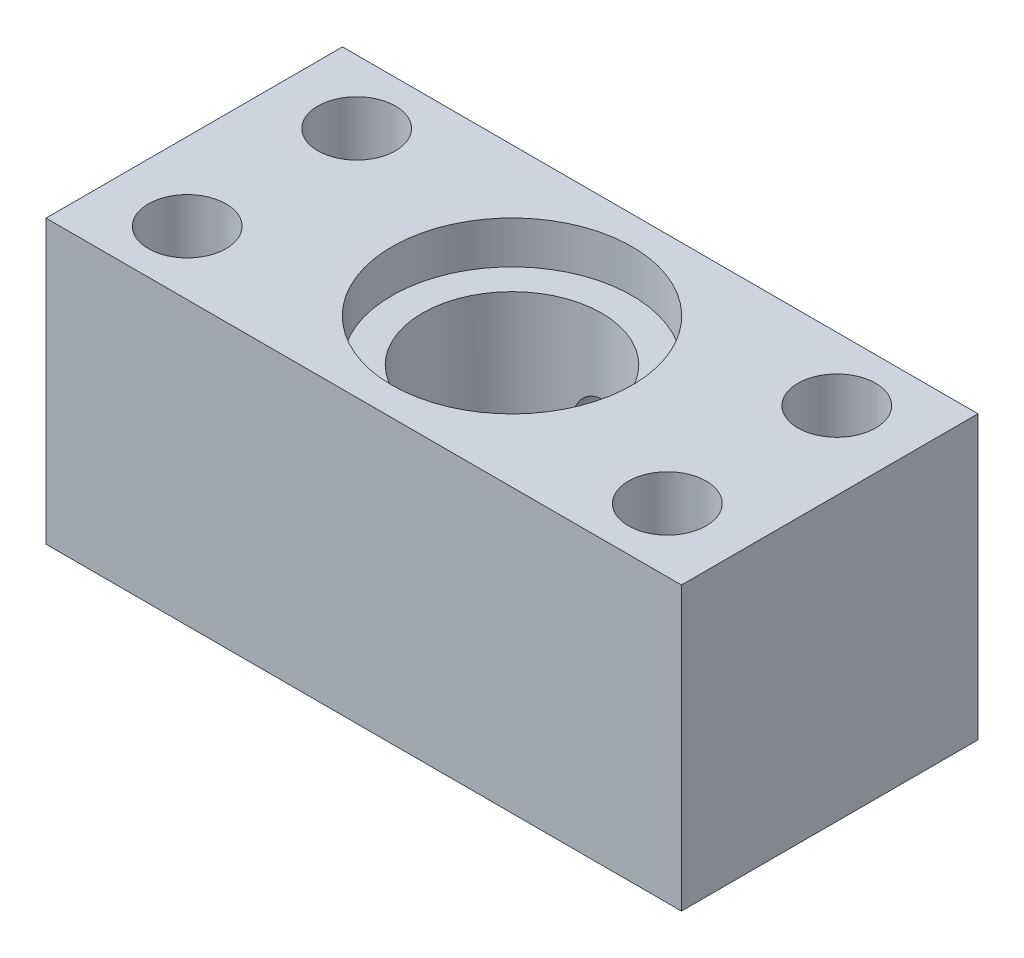
ISO-10303-21;
HEADER;
FILE_DESCRIPTION(('STEP AP214'),'2;1');
FILE_NAME('part.step','',(''),(''),'','','');
FILE_SCHEMA(('AUTOMOTIVE_DESIGN { 1 0 10303 214 1 1 1 1 }'));
ENDSEC;
DATA;
#1=APPLICATION_CONTEXT('core data for automotive mechanical design processes');
#2=APPLICATION_PROTOCOL_DEFINITION('international standard','automotive_design',2000,#1);
#3=PRODUCT_CONTEXT('',#1,'mechanical');
#4=PRODUCT('Part','Part','',(#3));
#5=PRODUCT_RELATED_PRODUCT_CATEGORY('part','',(#4));
#6=PRODUCT_DEFINITION_FORMATION('','',#4);
#7=PRODUCT_DEFINITION_CONTEXT('part definition',#1,'design');
#8=PRODUCT_DEFINITION('design','',#6,#7);
#9=PRODUCT_DEFINITION_SHAPE('','',#8);
#10=(LENGTH_UNIT() NAMED_UNIT(*) SI_UNIT(.MILLI.,.METRE.));
#11=(NAMED_UNIT(*) PLANE_ANGLE_UNIT() SI_UNIT($,.RADIAN.));
#12=(NAMED_UNIT(*) SI_UNIT($,.STERADIAN.) SOLID_ANGLE_UNIT());
#13=UNCERTAINTY_MEASURE_WITH_UNIT(LENGTH_MEASURE(1.E-05),#10,'distance_accuracy_value','');
#14=(GEOMETRIC_REPRESENTATION_CONTEXT(3) GLOBAL_UNCERTAINTY_ASSIGNED_CONTEXT((#13)) GLOBAL_UNIT_ASSIGNED_CONTEXT((#10,
#11,#12)) REPRESENTATION_CONTEXT('',''));
#15=CARTESIAN_POINT('',(0.,0.,0.));
#16=DIRECTION('',(0.,0.,1.));
#17=DIRECTION('',(1.,0.,0.));
#18=AXIS2_PLACEMENT_3D('',#15,#16,#17);
#19=CARTESIAN_POINT('',(0.,20.,0.));
#20=DIRECTION('',(1.,0.,0.));
#21=DIRECTION('',(0.,0.,-1.));
#22=AXIS2_PLACEMENT_3D('',#19,#20,#21);
#23=PLANE('',#22);
#24=DIRECTION('',(0.,0.,1.));
#25=VECTOR('',#24,1.);
#26=CARTESIAN_POINT('',(0.,0.,0.));
#27=LINE('',#26,#25);
#28=CARTESIAN_POINT('',(0.,0.,-21.));
#29=VERTEX_POINT('',#28);
#30=CARTESIAN_POINT('',(0.,0.,0.));
#31=VERTEX_POINT('',#30);
#32=EDGE_CURVE('E121',#29,#31,#27,.T.);
#33=ORIENTED_EDGE('',*,*,#32,.T.);
#34=DIRECTION('',(0.,-1.,0.));
#35=VECTOR('',#34,1.);
#36=CARTESIAN_POINT('',(0.,20.,0.));
#37=LINE('',#36,#35);
#38=CARTESIAN_POINT('',(0.,20.,0.));
#39=VERTEX_POINT('',#38);
#40=EDGE_CURVE('E13',#39,#31,#37,.T.);
#41=ORIENTED_EDGE('',*,*,#40,.F.);
#42=DIRECTION('',(0.,0.,1.));
#43=VECTOR('',#42,1.);
#44=CARTESIAN_POINT('',(0.,20.,0.));
#45=LINE('',#44,#43);
#46=CARTESIAN_POINT('',(0.,20.,-21.));
#47=VERTEX_POINT('',#46);
#48=EDGE_CURVE('E108',#47,#39,#45,.T.);
#49=ORIENTED_EDGE('',*,*,#48,.F.);
#50=DIRECTION('',(0.,-1.,0.));
#51=VECTOR('',#50,1.);
#52=CARTESIAN_POINT('',(0.,20.,-21.));
#53=LINE('',#52,#51);
#54=EDGE_CURVE('E117',#47,#29,#53,.T.);
#55=ORIENTED_EDGE('',*,*,#54,.T.);
#56=EDGE_LOOP('',(#33,#41,#49,#55));
#57=FACE_BOUND('',#56,.T.);
#58=ADVANCED_FACE('F50',(#57),#23,.F.);
#59=CARTESIAN_POINT('',(0.,20.,0.));
#60=DIRECTION('',(0.,0.,-1.));
#61=DIRECTION('',(-1.,0.,0.));
#62=AXIS2_PLACEMENT_3D('',#59,#60,#61);
#63=PLANE('',#62);
#64=DIRECTION('',(1.,0.,0.));
#65=VECTOR('',#64,1.);
#66=CARTESIAN_POINT('',(0.,0.,0.));
#67=LINE('',#66,#65);
#68=CARTESIAN_POINT('',(45.,0.,0.));
#69=VERTEX_POINT('',#68);
#70=EDGE_CURVE('E112',#31,#69,#67,.T.);
#71=ORIENTED_EDGE('',*,*,#70,.T.);
#72=DIRECTION('',(0.,-1.,0.));
#73=VECTOR('',#72,1.);
#74=CARTESIAN_POINT('',(45.,20.,0.));
#75=LINE('',#74,#73);
#76=CARTESIAN_POINT('',(45.,20.,0.));
#77=VERTEX_POINT('',#76);
#78=EDGE_CURVE('E64',#77,#69,#75,.T.);
#79=ORIENTED_EDGE('',*,*,#78,.F.);
#80=DIRECTION('',(1.,0.,0.));
#81=VECTOR('',#80,1.);
#82=CARTESIAN_POINT('',(0.,20.,0.));
#83=LINE('',#82,#81);
#84=EDGE_CURVE('E103',#39,#77,#83,.T.);
#85=ORIENTED_EDGE('',*,*,#84,.F.);
#86=ORIENTED_EDGE('',*,*,#40,.T.);
#87=EDGE_LOOP('',(#71,#79,#85,#86));
#88=FACE_BOUND('',#87,.T.);
#89=ADVANCED_FACE('F111',(#88),#63,.F.);
#90=CARTESIAN_POINT('',(45.,20.,0.));
#91=DIRECTION('',(-1.,0.,0.));
#92=DIRECTION('',(0.,0.,1.));
#93=AXIS2_PLACEMENT_3D('',#90,#91,#92);
#94=PLANE('',#93);
#95=DIRECTION('',(0.,0.,-1.));
#96=VECTOR('',#95,1.);
#97=CARTESIAN_POINT('',(45.,0.,0.));
#98=LINE('',#97,#96);
#99=CARTESIAN_POINT('',(45.,0.,-21.));
#100=VERTEX_POINT('',#99);
#101=EDGE_CURVE('E90',#69,#100,#98,.T.);
#102=ORIENTED_EDGE('',*,*,#101,.T.);
#103=DIRECTION('',(0.,-1.,0.));
#104=VECTOR('',#103,1.);
#105=CARTESIAN_POINT('',(45.,20.,-21.));
#106=LINE('',#105,#104);
#107=CARTESIAN_POINT('',(45.,20.,-21.));
#108=VERTEX_POINT('',#107);
#109=EDGE_CURVE('E113',#108,#100,#106,.T.);
#110=ORIENTED_EDGE('',*,*,#109,.F.);
#111=DIRECTION('',(0.,0.,-1.));
#112=VECTOR('',#111,1.);
#113=CARTESIAN_POINT('',(45.,20.,0.));
#114=LINE('',#113,#112);
#115=EDGE_CURVE('E106',#77,#108,#114,.T.);
#116=ORIENTED_EDGE('',*,*,#115,.F.);
#117=ORIENTED_EDGE('',*,*,#78,.T.);
#118=EDGE_LOOP('',(#102,#110,#116,#117));
#119=FACE_BOUND('',#118,.T.);
#120=ADVANCED_FACE('F115',(#119),#94,.F.);
#121=CARTESIAN_POINT('',(0.,20.,-21.));
#122=DIRECTION('',(0.,0.,1.));
#123=DIRECTION('',(1.,0.,0.));
#124=AXIS2_PLACEMENT_3D('',#121,#122,#123);
#125=PLANE('',#124);
#126=CARTESIAN_POINT('',(22.5,10.,-21.));
#127=DIRECTION('',(0.,0.,-1.));
#128=DIRECTION('',(-1.,0.,0.));
#129=AXIS2_PLACEMENT_3D('',#126,#127,#128);
#130=CIRCLE('',#129,1.7272);
#131=CARTESIAN_POINT('',(20.7728,10.,-21.));
#132=VERTEX_POINT('',#131);
#133=EDGE_CURVE('E143',#132,#132,#130,.T.);
#134=ORIENTED_EDGE('',*,*,#133,.F.);
#135=EDGE_LOOP('',(#134));
#136=FACE_BOUND('',#135,.T.);
#137=DIRECTION('',(-1.,0.,0.));
#138=VECTOR('',#137,1.);
#139=CARTESIAN_POINT('',(0.,0.,-21.));
#140=LINE('',#139,#138);
#141=EDGE_CURVE('E96',#100,#29,#140,.T.);
#142=ORIENTED_EDGE('',*,*,#141,.T.);
#143=ORIENTED_EDGE('',*,*,#54,.F.);
#144=DIRECTION('',(-1.,0.,0.));
#145=VECTOR('',#144,1.);
#146=CARTESIAN_POINT('',(0.,20.,-21.));
#147=LINE('',#146,#145);
#148=EDGE_CURVE('E73',#108,#47,#147,.T.);
#149=ORIENTED_EDGE('',*,*,#148,.F.);
#150=ORIENTED_EDGE('',*,*,#109,.T.);
#151=EDGE_LOOP('',(#142,#143,#149,#150));
#152=FACE_BOUND('',#151,.T.);
#153=ADVANCED_FACE('F181',(#136,#152),#125,.F.);
#154=CARTESIAN_POINT('',(0.,20.,0.));
#155=DIRECTION('',(0.,-1.,0.));
#156=DIRECTION('',(0.,0.,-1.));
#157=AXIS2_PLACEMENT_3D('',#154,#155,#156);
#158=PLANE('',#157);
#159=CARTESIAN_POINT('',(22.5,20.,-10.5));
#160=DIRECTION('',(0.,1.,0.));
#161=DIRECTION('',(0.,0.,1.));
#162=AXIS2_PLACEMENT_3D('',#159,#160,#161);
#163=CIRCLE('',#162,8.5);
#164=CARTESIAN_POINT('',(22.5,20.,-2.));
#165=VERTEX_POINT('',#164);
#166=EDGE_CURVE('E131',#165,#165,#163,.T.);
#167=ORIENTED_EDGE('',*,*,#166,.F.);
#168=EDGE_LOOP('',(#167));
#169=FACE_BOUND('',#168,.T.);
#170=CARTESIAN_POINT('',(39.5,20.,-4.5));
#171=DIRECTION('',(0.,-1.,0.));
#172=DIRECTION('',(0.,0.,-1.));
#173=AXIS2_PLACEMENT_3D('',#170,#171,#172);
#174=CIRCLE('',#173,2.75);
#175=CARTESIAN_POINT('',(39.5,20.,-7.25));
#176=VERTEX_POINT('',#175);
#177=EDGE_CURVE('E155',#176,#176,#174,.T.);
#178=ORIENTED_EDGE('',*,*,#177,.T.);
#179=EDGE_LOOP('',(#178));
#180=FACE_BOUND('',#179,.T.);
#181=CARTESIAN_POINT('',(5.5,20.,-16.5));
#182=DIRECTION('',(0.,-1.,0.));
#183=DIRECTION('',(0.,0.,-1.));
#184=AXIS2_PLACEMENT_3D('',#181,#182,#183);
#185=CIRCLE('',#184,2.75);
#186=CARTESIAN_POINT('',(5.5,20.,-19.25));
#187=VERTEX_POINT('',#186);
#188=EDGE_CURVE('E162',#187,#187,#185,.T.);
#189=ORIENTED_EDGE('',*,*,#188,.T.);
#190=EDGE_LOOP('',(#189));
#191=FACE_BOUND('',#190,.T.);
#192=CARTESIAN_POINT('',(5.5,20.,-4.5));
#193=DIRECTION('',(0.,-1.,0.));
#194=DIRECTION('',(0.,0.,-1.));
#195=AXIS2_PLACEMENT_3D('',#192,#193,#194);
#196=CIRCLE('',#195,2.75);
#197=CARTESIAN_POINT('',(5.5,20.,-7.25));
#198=VERTEX_POINT('',#197);
#199=EDGE_CURVE('E149',#198,#198,#196,.T.);
#200=ORIENTED_EDGE('',*,*,#199,.T.);
#201=EDGE_LOOP('',(#200));
#202=FACE_BOUND('',#201,.T.);
#203=CARTESIAN_POINT('',(39.5,20.,-16.5));
#204=DIRECTION('',(0.,-1.,0.));
#205=DIRECTION('',(0.,0.,-1.));
#206=AXIS2_PLACEMENT_3D('',#203,#204,#205);
#207=CIRCLE('',#206,2.75);
#208=CARTESIAN_POINT('',(39.5,20.,-19.25));
#209=VERTEX_POINT('',#208);
#210=EDGE_CURVE('E124',#209,#209,#207,.T.);
#211=ORIENTED_EDGE('',*,*,#210,.T.);
#212=EDGE_LOOP('',(#211));
#213=FACE_BOUND('',#212,.T.);
#214=ORIENTED_EDGE('',*,*,#48,.T.);
#215=ORIENTED_EDGE('',*,*,#84,.T.);
#216=ORIENTED_EDGE('',*,*,#115,.T.);
#217=ORIENTED_EDGE('',*,*,#148,.T.);
#218=EDGE_LOOP('',(#214,#215,#216,#217));
#219=FACE_BOUND('',#218,.T.);
#220=ADVANCED_FACE('F104',(#169,#180,#191,#202,#213,#219),#158,.F.);
#221=CARTESIAN_POINT('',(0.,0.,0.));
#222=DIRECTION('',(0.,-1.,0.));
#223=DIRECTION('',(0.,0.,-1.));
#224=AXIS2_PLACEMENT_3D('',#221,#222,#223);
#225=PLANE('',#224);
#226=CARTESIAN_POINT('',(22.5,0.,-10.5));
#227=DIRECTION('',(0.,-1.,0.));
#228=DIRECTION('',(0.,0.,-1.));
#229=AXIS2_PLACEMENT_3D('',#226,#227,#228);
#230=CIRCLE('',#229,6.34999999999999);
#231=CARTESIAN_POINT('',(22.5,0.,-16.85));
#232=VERTEX_POINT('',#231);
#233=EDGE_CURVE('E132',#232,#232,#230,.T.);
#234=ORIENTED_EDGE('',*,*,#233,.F.);
#235=EDGE_LOOP('',(#234));
#236=FACE_BOUND('',#235,.T.);
#237=CARTESIAN_POINT('',(39.5,0.,-4.5));
#238=DIRECTION('',(0.,-1.,0.));
#239=DIRECTION('',(0.,0.,-1.));
#240=AXIS2_PLACEMENT_3D('',#237,#238,#239);
#241=CIRCLE('',#240,2.75);
#242=CARTESIAN_POINT('',(39.5,0.,-7.25));
#243=VERTEX_POINT('',#242);
#244=EDGE_CURVE('E159',#243,#243,#241,.T.);
#245=ORIENTED_EDGE('',*,*,#244,.F.);
#246=EDGE_LOOP('',(#245));
#247=FACE_BOUND('',#246,.T.);
#248=CARTESIAN_POINT('',(5.5,0.,-16.5));
#249=DIRECTION('',(0.,-1.,0.));
#250=DIRECTION('',(0.,0.,-1.));
#251=AXIS2_PLACEMENT_3D('',#248,#249,#250);
#252=CIRCLE('',#251,2.75);
#253=CARTESIAN_POINT('',(5.5,0.,-19.25));
#254=VERTEX_POINT('',#253);
#255=EDGE_CURVE('E152',#254,#254,#252,.T.);
#256=ORIENTED_EDGE('',*,*,#255,.F.);
#257=EDGE_LOOP('',(#256));
#258=FACE_BOUND('',#257,.T.);
#259=CARTESIAN_POINT('',(5.5,0.,-4.5));
#260=DIRECTION('',(0.,-1.,0.));
#261=DIRECTION('',(0.,0.,-1.));
#262=AXIS2_PLACEMENT_3D('',#259,#260,#261);
#263=CIRCLE('',#262,2.75);
#264=CARTESIAN_POINT('',(5.5,0.,-7.25));
#265=VERTEX_POINT('',#264);
#266=EDGE_CURVE('E147',#265,#265,#263,.T.);
#267=ORIENTED_EDGE('',*,*,#266,.F.);
#268=EDGE_LOOP('',(#267));
#269=FACE_BOUND('',#268,.T.);
#270=CARTESIAN_POINT('',(39.5,0.,-16.5));
#271=DIRECTION('',(0.,-1.,0.));
#272=DIRECTION('',(0.,0.,-1.));
#273=AXIS2_PLACEMENT_3D('',#270,#271,#272);
#274=CIRCLE('',#273,2.75);
#275=CARTESIAN_POINT('',(39.5,0.,-19.25));
#276=VERTEX_POINT('',#275);
#277=EDGE_CURVE('E158',#276,#276,#274,.T.);
#278=ORIENTED_EDGE('',*,*,#277,.F.);
#279=EDGE_LOOP('',(#278));
#280=FACE_BOUND('',#279,.T.);
#281=ORIENTED_EDGE('',*,*,#32,.F.);
#282=ORIENTED_EDGE('',*,*,#141,.F.);
#283=ORIENTED_EDGE('',*,*,#101,.F.);
#284=ORIENTED_EDGE('',*,*,#70,.F.);
#285=EDGE_LOOP('',(#281,#282,#283,#284));
#286=FACE_BOUND('',#285,.T.);
#287=ADVANCED_FACE('F174',(#236,#247,#258,#269,#280,#286),#225,.T.);
#288=CARTESIAN_POINT('',(39.5,20.,-16.5));
#289=DIRECTION('',(0.,-1.,0.));
#290=DIRECTION('',(0.,0.,-1.));
#291=AXIS2_PLACEMENT_3D('',#288,#289,#290);
#292=CYLINDRICAL_SURFACE('',#291,2.75);
#293=ORIENTED_EDGE('',*,*,#210,.F.);
#294=EDGE_LOOP('',(#293));
#295=FACE_BOUND('',#294,.T.);
#296=ORIENTED_EDGE('',*,*,#277,.T.);
#297=EDGE_LOOP('',(#296));
#298=FACE_BOUND('',#297,.T.);
#299=ADVANCED_FACE('F172',(#295,#298),#292,.F.);
#300=CARTESIAN_POINT('',(5.5,20.,-4.5));
#301=DIRECTION('',(0.,-1.,0.));
#302=DIRECTION('',(0.,0.,-1.));
#303=AXIS2_PLACEMENT_3D('',#300,#301,#302);
#304=CYLINDRICAL_SURFACE('',#303,2.75);
#305=ORIENTED_EDGE('',*,*,#199,.F.);
#306=EDGE_LOOP('',(#305));
#307=FACE_BOUND('',#306,.T.);
#308=ORIENTED_EDGE('',*,*,#266,.T.);
#309=EDGE_LOOP('',(#308));
#310=FACE_BOUND('',#309,.T.);
#311=ADVANCED_FACE('F213',(#307,#310),#304,.F.);
#312=CARTESIAN_POINT('',(5.5,20.,-16.5));
#313=DIRECTION('',(0.,-1.,0.));
#314=DIRECTION('',(0.,0.,-1.));
#315=AXIS2_PLACEMENT_3D('',#312,#313,#314);
#316=CYLINDRICAL_SURFACE('',#315,2.75);
#317=ORIENTED_EDGE('',*,*,#188,.F.);
#318=EDGE_LOOP('',(#317));
#319=FACE_BOUND('',#318,.T.);
#320=ORIENTED_EDGE('',*,*,#255,.T.);
#321=EDGE_LOOP('',(#320));
#322=FACE_BOUND('',#321,.T.);
#323=ADVANCED_FACE('F224',(#319,#322),#316,.F.);
#324=CARTESIAN_POINT('',(39.5,20.,-4.5));
#325=DIRECTION('',(0.,-1.,0.));
#326=DIRECTION('',(0.,0.,-1.));
#327=AXIS2_PLACEMENT_3D('',#324,#325,#326);
#328=CYLINDRICAL_SURFACE('',#327,2.75);
#329=ORIENTED_EDGE('',*,*,#177,.F.);
#330=EDGE_LOOP('',(#329));
#331=FACE_BOUND('',#330,.T.);
#332=ORIENTED_EDGE('',*,*,#244,.T.);
#333=EDGE_LOOP('',(#332));
#334=FACE_BOUND('',#333,.T.);
#335=ADVANCED_FACE('F234',(#331,#334),#328,.F.);
#336=CARTESIAN_POINT('',(22.5,17.,-10.5));
#337=DIRECTION('',(0.,1.,0.));
#338=DIRECTION('',(0.,0.,1.));
#339=AXIS2_PLACEMENT_3D('',#336,#337,#338);
#340=CYLINDRICAL_SURFACE('',#339,8.5);
#341=CARTESIAN_POINT('',(22.5,17.,-10.5));
#342=DIRECTION('',(0.,1.,0.));
#343=DIRECTION('',(0.,0.,1.));
#344=AXIS2_PLACEMENT_3D('',#341,#342,#343);
#345=CIRCLE('',#344,8.5);
#346=CARTESIAN_POINT('',(22.5,17.,-2.));
#347=VERTEX_POINT('',#346);
#348=EDGE_CURVE('E136',#347,#347,#345,.T.);
#349=ORIENTED_EDGE('',*,*,#348,.F.);
#350=EDGE_LOOP('',(#349));
#351=FACE_BOUND('',#350,.T.);
#352=ORIENTED_EDGE('',*,*,#166,.T.);
#353=EDGE_LOOP('',(#352));
#354=FACE_BOUND('',#353,.T.);
#355=ADVANCED_FACE('F244',(#351,#354),#340,.F.);
#356=CARTESIAN_POINT('',(22.5,17.,-10.5));
#357=DIRECTION('',(0.,1.,0.));
#358=DIRECTION('',(0.,0.,1.));
#359=AXIS2_PLACEMENT_3D('',#356,#357,#358);
#360=PLANE('',#359);
#361=CARTESIAN_POINT('',(22.5,17.,-10.5));
#362=DIRECTION('',(0.,1.,0.));
#363=DIRECTION('',(0.,0.,1.));
#364=AXIS2_PLACEMENT_3D('',#361,#362,#363);
#365=CIRCLE('',#364,6.34999999999999);
#366=CARTESIAN_POINT('',(22.5,17.,-4.15000000000001));
#367=VERTEX_POINT('',#366);
#368=EDGE_CURVE('E129',#367,#367,#365,.T.);
#369=ORIENTED_EDGE('',*,*,#368,.F.);
#370=EDGE_LOOP('',(#369));
#371=FACE_BOUND('',#370,.T.);
#372=ORIENTED_EDGE('',*,*,#348,.T.);
#373=EDGE_LOOP('',(#372));
#374=FACE_BOUND('',#373,.T.);
#375=ADVANCED_FACE('F260',(#371,#374),#360,.T.);
#376=CARTESIAN_POINT('',(22.5,0.,-10.5));
#377=DIRECTION('',(0.,-1.,0.));
#378=DIRECTION('',(0.,0.,-1.));
#379=AXIS2_PLACEMENT_3D('',#376,#377,#378);
#380=CYLINDRICAL_SURFACE('',#379,6.34999999999999);
#381=CARTESIAN_POINT('',(22.5,11.7272,-16.85));
#382=CARTESIAN_POINT('',(22.5951449863036,11.7271978914721,-16.8499986387594));
#383=CARTESIAN_POINT('',(22.6903122888515,11.7193119083609,-16.8478406434685));
#384=CARTESIAN_POINT('',(22.8779007847455,11.6880350463608,-16.8394417257679));
#385=CARTESIAN_POINT('',(22.9703207143826,11.6646371443202,-16.8331989539579));
#386=CARTESIAN_POINT('',(23.1496799403519,11.6031568986413,-16.8173187640148));
#387=CARTESIAN_POINT('',(23.2366262866875,11.5650939133461,-16.8076858224507));
#388=CARTESIAN_POINT('',(23.4029015747411,11.4754369206039,-16.7860407266537));
#389=CARTESIAN_POINT('',(23.4822299273075,11.4238418677788,-16.7740283886254));
#390=CARTESIAN_POINT('',(23.6329244606658,11.3072761101062,-16.7485961318959));
#391=CARTESIAN_POINT('',(23.7040814277844,11.242040348752,-16.7351513968222));
#392=CARTESIAN_POINT('',(23.8345919585713,11.1006113107717,-16.7085272168934));
#393=CARTESIAN_POINT('',(23.8939439367701,11.0244165646634,-16.6953478078862));
#394=CARTESIAN_POINT('',(24.0001919760879,10.8615472653922,-16.6704913714835));
#395=CARTESIAN_POINT('',(24.0468451272284,10.7747090421205,-16.6588455857585));
#396=CARTESIAN_POINT('',(24.1248057685999,10.5940531566705,-16.6387407874426));
#397=CARTESIAN_POINT('',(24.1561162159453,10.5002368434496,-16.6302811608322));
#398=CARTESIAN_POINT('',(24.2017718021468,10.3106101126478,-16.6177630956924));
#399=CARTESIAN_POINT('',(24.2164972699097,10.2148979270688,-16.6136061761792));
#400=CARTESIAN_POINT('',(24.2297509473164,10.02227835069,-16.6098701388338));
#401=CARTESIAN_POINT('',(24.2282823163445,9.92537119670718,-16.6102901280702));
#402=CARTESIAN_POINT('',(24.2094909326771,9.73609947123521,-16.6155724421581));
#403=CARTESIAN_POINT('',(24.1926307931423,9.64368477354556,-16.6203051353099));
#404=CARTESIAN_POINT('',(24.144276913663,9.46304801188243,-16.6334717099912));
#405=CARTESIAN_POINT('',(24.1127819621268,9.3748262957056,-16.6419058979582));
#406=CARTESIAN_POINT('',(24.0356811628481,9.20388536879236,-16.6616374926248));
#407=CARTESIAN_POINT('',(23.9899150135434,9.12124234000684,-16.6729671478322));
#408=CARTESIAN_POINT('',(23.8856827053714,8.96464765257256,-16.6971960587819));
#409=CARTESIAN_POINT('',(23.8272139558475,8.89069777161298,-16.7100956344682));
#410=CARTESIAN_POINT('',(23.6968811093987,8.7509482409435,-16.7365484267537));
#411=CARTESIAN_POINT('',(23.6246292006418,8.68551112904993,-16.7501089561857));
#412=CARTESIAN_POINT('',(23.4700107247536,8.56760646666904,-16.7759631968626));
#413=CARTESIAN_POINT('',(23.3876437266867,8.51513946903778,-16.7882568540934));
#414=CARTESIAN_POINT('',(23.214556958944,8.42449576466481,-16.8102729424173));
#415=CARTESIAN_POINT('',(23.1237999909695,8.38638691286079,-16.8199831023108));
#416=CARTESIAN_POINT('',(22.9368425978052,8.32607348110458,-16.8356495293186));
#417=CARTESIAN_POINT('',(22.8406434171782,8.30386528061887,-16.8416066509521));
#418=CARTESIAN_POINT('',(22.6486244548842,8.27655800182055,-16.8489656531005));
#419=CARTESIAN_POINT('',(22.5528796523448,8.27096627599483,-16.8504986594763));
#420=CARTESIAN_POINT('',(22.3618195336493,8.27568706727376,-16.849214871612));
#421=CARTESIAN_POINT('',(22.2665041722797,8.28599786889325,-16.8463985465559));
#422=CARTESIAN_POINT('',(22.0807823527651,8.32182770991179,-16.8368174354787));
#423=CARTESIAN_POINT('',(21.9903184457,8.34706996741095,-16.8301245544194));
#424=CARTESIAN_POINT('',(21.8149194841249,8.41172301107799,-16.8135514774359));
#425=CARTESIAN_POINT('',(21.7299850419685,8.4511353633533,-16.8036709292167));
#426=CARTESIAN_POINT('',(21.5661571287015,8.54391015753947,-16.7815136737374));
#427=CARTESIAN_POINT('',(21.487420077066,8.59753796387577,-16.7691926515692));
#428=CARTESIAN_POINT('',(21.3398904015496,8.71688954499192,-16.7435776351725));
#429=CARTESIAN_POINT('',(21.2710998291865,8.78261580881089,-16.7302834410712));
#430=CARTESIAN_POINT('',(21.143325109141,8.92660078405838,-16.7037346400859));
#431=CARTESIAN_POINT('',(21.0846891110347,9.00517137654907,-16.6904927106257));
#432=CARTESIAN_POINT('',(20.9814241368911,9.17131885211516,-16.6659755764366));
#433=CARTESIAN_POINT('',(20.9367945972313,9.25889537260204,-16.6547002925776));
#434=CARTESIAN_POINT('',(20.8631440248631,9.44014848343661,-16.6355237539968));
#435=CARTESIAN_POINT('',(20.8340341956804,9.53378685645487,-16.6276033589658));
#436=CARTESIAN_POINT('',(20.7920498143142,9.7248830851753,-16.6160354357263));
#437=CARTESIAN_POINT('',(20.7791709071315,9.8223399090906,-16.6123867613699));
#438=CARTESIAN_POINT('',(20.770271793929,10.0147346576291,-16.6098738530768));
#439=CARTESIAN_POINT('',(20.773690895503,10.1096449495762,-16.6108504892328));
#440=CARTESIAN_POINT('',(20.795984358356,10.2974809474843,-16.6171040483643));
#441=CARTESIAN_POINT('',(20.8148582909703,10.3904067084161,-16.6223808520676));
#442=CARTESIAN_POINT('',(20.8671946052146,10.5708981053916,-16.6365435385507));
#443=CARTESIAN_POINT('',(20.9005336488138,10.658502072731,-16.6453988658739));
#444=CARTESIAN_POINT('',(20.9807582611368,10.8269403563795,-16.6657204924244));
#445=CARTESIAN_POINT('',(21.0276460322426,10.9077735693267,-16.677187216077));
#446=CARTESIAN_POINT('',(21.1353172024515,11.0630409330255,-16.7018767482345));
#447=CARTESIAN_POINT('',(21.1964810411298,11.1372044705423,-16.7151424734096));
#448=CARTESIAN_POINT('',(21.3302505521444,11.2743972273559,-16.7417007617065));
#449=CARTESIAN_POINT('',(21.4028590277416,11.3374237106879,-16.7549933306137));
#450=CARTESIAN_POINT('',(21.5594301595586,11.4519523157559,-16.7804658706828));
#451=CARTESIAN_POINT('',(21.643611759726,11.5031628184121,-16.7926140297333));
#452=CARTESIAN_POINT('',(21.8197178221312,11.5906250539881,-16.814076418631));
#453=CARTESIAN_POINT('',(21.9116374723591,11.6268860019416,-16.8233923933281));
#454=CARTESIAN_POINT('',(22.0859595149483,11.6789114723579,-16.8369945638228));
#455=CARTESIAN_POINT('',(22.167639275079,11.6969765949376,-16.8418353608597));
#456=CARTESIAN_POINT('',(22.3328737528219,11.7211211399232,-16.848338505771));
#457=CARTESIAN_POINT('',(22.4164282677005,11.7272018520506,-16.8500011956619));
#458=CARTESIAN_POINT('',(22.5,11.7272,-16.85));
#459=B_SPLINE_CURVE_WITH_KNOTS('',3,(#381,#382,#383,#384,#385,#386,#387,#388,#389,#390,#391,
#392,#393,#394,#395,#396,#397,#398,#399,#400,#401,#402,#403,#404,#405,#406,#407,#408,#409,#410,
#411,#412,#413,#414,#415,#416,#417,#418,#419,#420,#421,#422,#423,#424,#425,#426,#427,#428,#429,
#430,#431,#432,#433,#434,#435,#436,#437,#438,#439,#440,#441,#442,#443,#444,#445,#446,#447,#448,
#449,#450,#451,#452,#453,#454,#455,#456,#457,#458),.UNSPECIFIED.,.T.,.F.,(4,2,2,2,2,2,2,2,2,2,2,
2,2,2,2,2,2,2,2,2,2,2,2,2,2,2,2,2,2,2,2,2,2,2,2,2,2,2,4),(0.,0.285128405017793,0.57038599256176,
0.855268314675111,1.1401726509786,1.43123640676031,1.72233922751515,2.01867139312996,
2.31494642193913,2.60427934323215,2.89355581817747,3.17441408333315,3.45529560441984,
3.73945326293842,4.02366892903956,4.31754671771736,4.611437030889,4.90669931535445,
5.20189434803006,5.48824548103982,5.7745657260811,6.05573785032931,6.33694105984502,
6.62381671145077,6.91075144863872,7.20612995590426,7.50149657556013,7.7951546002332,
8.08873381527748,8.37228753102226,8.65583338221402,8.93700765801566,9.21822766518483,
9.50803100601368,9.79790544219254,10.094310404606,10.3905323862964,10.6410052744421,
10.8914512060763),.UNSPECIFIED.);
#460=CARTESIAN_POINT('',(22.5,11.7272,-16.85));
#461=VERTEX_POINT('',#460);
#462=EDGE_CURVE('E53',#461,#461,#459,.T.);
#463=ORIENTED_EDGE('',*,*,#462,.T.);
#464=EDGE_LOOP('',(#463));
#465=FACE_BOUND('',#464,.T.);
#466=ORIENTED_EDGE('',*,*,#368,.T.);
#467=EDGE_LOOP('',(#466));
#468=FACE_BOUND('',#467,.T.);
#469=ORIENTED_EDGE('',*,*,#233,.T.);
#470=EDGE_LOOP('',(#469));
#471=FACE_BOUND('',#470,.T.);
#472=ADVANCED_FACE('F274',(#465,#468,#471),#380,.F.);
#473=CARTESIAN_POINT('',(22.5,10.,-21.));
#474=DIRECTION('',(0.,0.,-1.));
#475=DIRECTION('',(-1.,0.,0.));
#476=AXIS2_PLACEMENT_3D('',#473,#474,#475);
#477=CYLINDRICAL_SURFACE('',#476,1.7272);
#478=ORIENTED_EDGE('',*,*,#133,.T.);
#479=EDGE_LOOP('',(#478));
#480=FACE_BOUND('',#479,.T.);
#481=ORIENTED_EDGE('',*,*,#462,.F.);
#482=EDGE_LOOP('',(#481));
#483=FACE_BOUND('',#482,.T.);
#484=ADVANCED_FACE('F289',(#480,#483),#477,.F.);
#485=CLOSED_SHELL('',(#58,#89,#120,#153,#220,#287,#299,#311,#323,#335,#355,#375,#472,#484));
#486=MANIFOLD_SOLID_BREP('B2',#485);
#487=ADVANCED_BREP_SHAPE_REPRESENTATION('',(#18,#486),#14);
#488=SHAPE_DEFINITION_REPRESENTATION(#9,#487);
ENDSEC;
END-ISO-10303-21;
